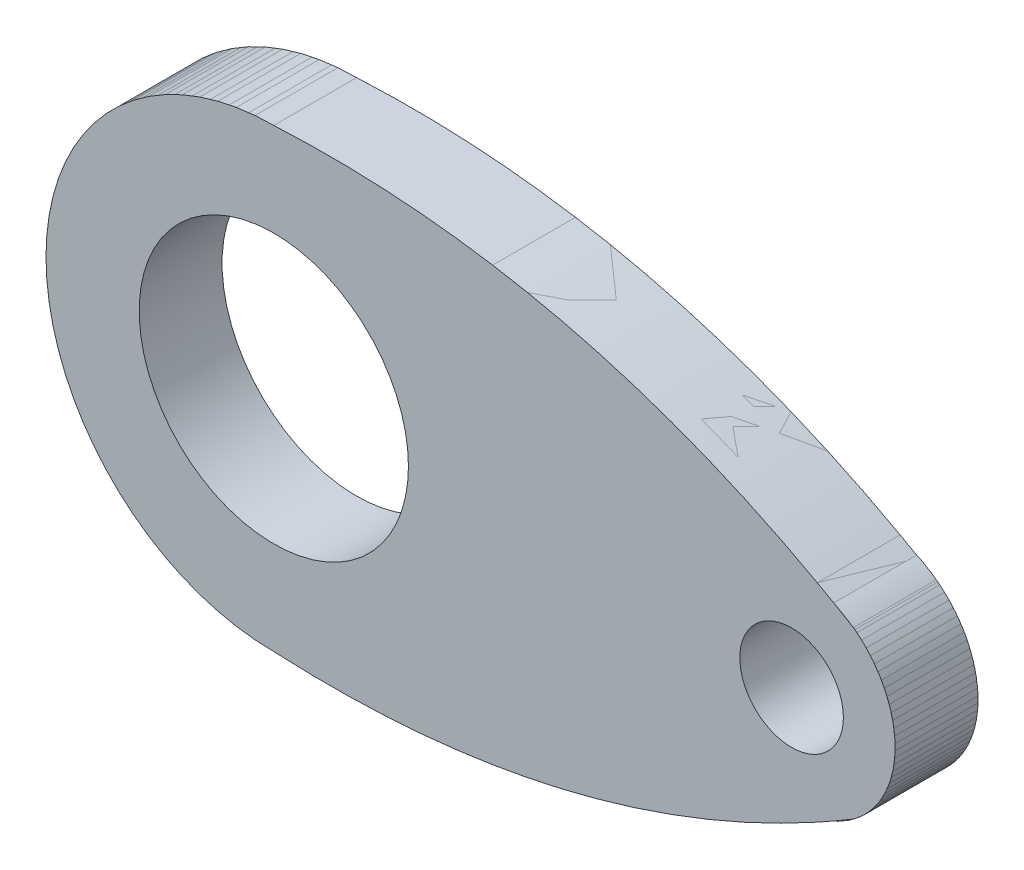
ISO-10303-21;
HEADER;
FILE_DESCRIPTION(('STEP AP214'),'2;1');
FILE_NAME('part.step','',(''),(''),'','','');
FILE_SCHEMA(('AUTOMOTIVE_DESIGN { 1 0 10303 214 1 1 1 1 }'));
ENDSEC;
DATA;
#1=APPLICATION_CONTEXT('core data for automotive mechanical design processes');
#2=APPLICATION_PROTOCOL_DEFINITION('international standard','automotive_design',2000,#1);
#3=PRODUCT_CONTEXT('',#1,'mechanical');
#4=PRODUCT('Part','Part','',(#3));
#5=PRODUCT_RELATED_PRODUCT_CATEGORY('part','',(#4));
#6=PRODUCT_DEFINITION_FORMATION('','',#4);
#7=PRODUCT_DEFINITION_CONTEXT('part definition',#1,'design');
#8=PRODUCT_DEFINITION('design','',#6,#7);
#9=PRODUCT_DEFINITION_SHAPE('','',#8);
#10=(LENGTH_UNIT() NAMED_UNIT(*) SI_UNIT(.MILLI.,.METRE.));
#11=(NAMED_UNIT(*) PLANE_ANGLE_UNIT() SI_UNIT($,.RADIAN.));
#12=(NAMED_UNIT(*) SI_UNIT($,.STERADIAN.) SOLID_ANGLE_UNIT());
#13=UNCERTAINTY_MEASURE_WITH_UNIT(LENGTH_MEASURE(1.E-05),#10,'distance_accuracy_value','');
#14=(GEOMETRIC_REPRESENTATION_CONTEXT(3) GLOBAL_UNCERTAINTY_ASSIGNED_CONTEXT((#13)) GLOBAL_UNIT_ASSIGNED_CONTEXT((#10,
#11,#12)) REPRESENTATION_CONTEXT('',''));
#15=CARTESIAN_POINT('',(0.,0.,0.));
#16=DIRECTION('',(0.,0.,1.));
#17=DIRECTION('',(1.,0.,0.));
#18=AXIS2_PLACEMENT_3D('',#15,#16,#17);
#19=CARTESIAN_POINT('',(-0.00634119172110252,-10.9999981600629,0.));
#20=CARTESIAN_POINT('',(15.1270318904217,-11.7684176821271,0.));
#21=CARTESIAN_POINT('',(28.0539293411729,-3.96618382733438,0.));
#22=B_SPLINE_CURVE_WITH_KNOTS('',2,(#19,#20,#21),.UNSPECIFIED.,.F.,.F.,(3,3),(0.,1.),.UNSPECIFIED.);
#23=DIRECTION('',(0.,0.,1.));
#24=VECTOR('',#23,1.);
#25=SURFACE_OF_LINEAR_EXTRUSION('',#22,#24);
#26=CARTESIAN_POINT('',(-0.00634119172110252,-10.9999981600629,4.));
#27=CARTESIAN_POINT('',(15.1270318904217,-11.7684176821271,4.));
#28=CARTESIAN_POINT('',(28.0539293411729,-3.96618382733438,4.));
#29=B_SPLINE_CURVE_WITH_KNOTS('',2,(#26,#27,#28),.UNSPECIFIED.,.F.,.F.,(3,3),(0.,1.),.UNSPECIFIED.);
#30=CARTESIAN_POINT('',(-0.00634119172110252,-10.9999981600629,4.));
#31=VERTEX_POINT('',#30);
#32=CARTESIAN_POINT('',(28.0539293411729,-3.96618382733438,4.));
#33=VERTEX_POINT('',#32);
#34=EDGE_CURVE('E74',#31,#33,#29,.T.);
#35=ORIENTED_EDGE('',*,*,#34,.F.);
#36=DIRECTION('',(0.,0.,1.));
#37=VECTOR('',#36,1.);
#38=CARTESIAN_POINT('',(-0.00634119172110252,-10.9999981600629,0.));
#39=LINE('',#38,#37);
#40=CARTESIAN_POINT('',(-0.00634119172110252,-10.9999981600629,0.));
#41=VERTEX_POINT('',#40);
#42=EDGE_CURVE('E56',#41,#31,#39,.T.);
#43=ORIENTED_EDGE('',*,*,#42,.F.);
#44=CARTESIAN_POINT('',(28.0539293411729,-3.96618382733438,0.));
#45=VERTEX_POINT('',#44);
#46=EDGE_CURVE('E62',#41,#45,#22,.T.);
#47=ORIENTED_EDGE('',*,*,#46,.T.);
#48=DIRECTION('',(0.,0.,1.));
#49=VECTOR('',#48,1.);
#50=CARTESIAN_POINT('',(28.0539293411729,-3.96618382733438,0.));
#51=LINE('',#50,#49);
#52=EDGE_CURVE('E12',#45,#33,#51,.T.);
#53=ORIENTED_EDGE('',*,*,#52,.T.);
#54=EDGE_LOOP('',(#35,#43,#47,#53));
#55=FACE_BOUND('',#54,.T.);
#56=ADVANCED_FACE('F54',(#55),#25,.T.);
#57=OPEN_SHELL('',(#56));
#58=SHELL_BASED_SURFACE_MODEL('B2',(#57));
#59=CARTESIAN_POINT('',(0.,11.,0.));
#60=CARTESIAN_POINT('',(15.1338132924348,11.7596957030618,0.));
#61=CARTESIAN_POINT('',(28.0562107953029,3.95001154992234,0.));
#62=B_SPLINE_CURVE_WITH_KNOTS('',2,(#59,#60,#61),.UNSPECIFIED.,.F.,.F.,(3,3),(0.,1.),.UNSPECIFIED.);
#63=DIRECTION('',(0.,0.,1.));
#64=VECTOR('',#63,1.);
#65=SURFACE_OF_LINEAR_EXTRUSION('',#62,#64);
#66=CARTESIAN_POINT('',(0.,11.,4.));
#67=CARTESIAN_POINT('',(15.1338132924348,11.7596957030618,4.));
#68=CARTESIAN_POINT('',(28.0562107953029,3.95001154992234,4.));
#69=B_SPLINE_CURVE_WITH_KNOTS('',2,(#66,#67,#68),.UNSPECIFIED.,.F.,.F.,(3,3),(0.,1.),.UNSPECIFIED.);
#70=CARTESIAN_POINT('',(0.,11.,4.));
#71=VERTEX_POINT('',#70);
#72=CARTESIAN_POINT('',(28.0562107953029,3.95001154992234,4.));
#73=VERTEX_POINT('',#72);
#74=EDGE_CURVE('E137',#71,#73,#69,.T.);
#75=ORIENTED_EDGE('',*,*,#74,.F.);
#76=DIRECTION('',(0.,0.,1.));
#77=VECTOR('',#76,1.);
#78=CARTESIAN_POINT('',(0.,11.,0.));
#79=LINE('',#78,#77);
#80=CARTESIAN_POINT('',(0.,11.,0.));
#81=VERTEX_POINT('',#80);
#82=EDGE_CURVE('E119',#81,#71,#79,.T.);
#83=ORIENTED_EDGE('',*,*,#82,.F.);
#84=CARTESIAN_POINT('',(28.0562107953029,3.95001154992234,0.));
#85=VERTEX_POINT('',#84);
#86=EDGE_CURVE('E125',#81,#85,#62,.T.);
#87=ORIENTED_EDGE('',*,*,#86,.T.);
#88=DIRECTION('',(0.,0.,1.));
#89=VECTOR('',#88,1.);
#90=CARTESIAN_POINT('',(28.0562107953029,3.95001154992234,0.));
#91=LINE('',#90,#89);
#92=EDGE_CURVE('E52',#85,#73,#91,.T.);
#93=ORIENTED_EDGE('',*,*,#92,.T.);
#94=EDGE_LOOP('',(#75,#83,#87,#93));
#95=FACE_BOUND('',#94,.T.);
#96=ADVANCED_FACE('F117',(#95),#65,.T.);
#97=OPEN_SHELL('',(#96));
#98=SHELL_BASED_SURFACE_MODEL('B6',(#97));
#99=CARTESIAN_POINT('',(24.9999989615263,-0.00720580916772559,0.));
#100=DIRECTION('',(0.,0.,1.));
#101=DIRECTION('',(1.,0.,0.));
#102=AXIS2_PLACEMENT_3D('',#99,#100,#101);
#103=CYLINDRICAL_SURFACE('',#102,5.);
#104=CARTESIAN_POINT('',(24.9999989615263,-0.00720580916772559,0.));
#105=DIRECTION('',(0.,0.,1.));
#106=DIRECTION('',(1.,0.,0.));
#107=AXIS2_PLACEMENT_3D('',#104,#105,#106);
#108=CIRCLE('',#107,5.);
#109=CARTESIAN_POINT('',(29.9999989615263,-0.00720580916772559,0.));
#110=VERTEX_POINT('',#109);
#111=EDGE_CURVE('E184',#110,#110,#108,.T.);
#112=ORIENTED_EDGE('',*,*,#111,.T.);
#113=EDGE_LOOP('',(#112));
#114=FACE_BOUND('',#113,.T.);
#115=CARTESIAN_POINT('',(24.9999989615263,-0.00720580916772559,4.));
#116=DIRECTION('',(0.,0.,1.));
#117=DIRECTION('',(1.,0.,0.));
#118=AXIS2_PLACEMENT_3D('',#115,#116,#117);
#119=CIRCLE('',#118,5.);
#120=CARTESIAN_POINT('',(29.9999989615263,-0.00720580916772559,4.));
#121=VERTEX_POINT('',#120);
#122=EDGE_CURVE('E116',#121,#121,#119,.T.);
#123=ORIENTED_EDGE('',*,*,#122,.F.);
#124=EDGE_LOOP('',(#123));
#125=FACE_BOUND('',#124,.T.);
#126=ADVANCED_FACE('F180',(#114,#125),#103,.T.);
#127=OPEN_SHELL('',(#126));
#128=SHELL_BASED_SURFACE_MODEL('B46',(#127));
#129=CARTESIAN_POINT('',(0.,0.,0.));
#130=DIRECTION('',(0.,0.,1.));
#131=DIRECTION('',(1.,0.,0.));
#132=AXIS2_PLACEMENT_3D('',#129,#130,#131);
#133=CYLINDRICAL_SURFACE('',#132,11.);
#134=CARTESIAN_POINT('',(0.,0.,0.));
#135=DIRECTION('',(0.,0.,1.));
#136=DIRECTION('',(1.,0.,0.));
#137=AXIS2_PLACEMENT_3D('',#134,#135,#136);
#138=CIRCLE('',#137,11.);
#139=CARTESIAN_POINT('',(11.,0.,0.));
#140=VERTEX_POINT('',#139);
#141=EDGE_CURVE('E218',#140,#140,#138,.T.);
#142=ORIENTED_EDGE('',*,*,#141,.T.);
#143=EDGE_LOOP('',(#142));
#144=FACE_BOUND('',#143,.T.);
#145=CARTESIAN_POINT('',(0.,0.,4.));
#146=DIRECTION('',(0.,0.,1.));
#147=DIRECTION('',(1.,0.,0.));
#148=AXIS2_PLACEMENT_3D('',#145,#146,#147);
#149=CIRCLE('',#148,11.);
#150=CARTESIAN_POINT('',(11.,0.,4.));
#151=VERTEX_POINT('',#150);
#152=EDGE_CURVE('E179',#151,#151,#149,.T.);
#153=ORIENTED_EDGE('',*,*,#152,.F.);
#154=EDGE_LOOP('',(#153));
#155=FACE_BOUND('',#154,.T.);
#156=ADVANCED_FACE('F214',(#144,#155),#133,.T.);
#157=OPEN_SHELL('',(#156));
#158=SHELL_BASED_SURFACE_MODEL('B111',(#157));
#159=CARTESIAN_POINT('',(0.,0.,4.));
#160=DIRECTION('',(0.,0.,-1.));
#161=DIRECTION('',(-1.,0.,0.));
#162=AXIS2_PLACEMENT_3D('',#159,#160,#161);
#163=CYLINDRICAL_SURFACE('',#162,11.);
#164=CARTESIAN_POINT('',(0.,0.,4.));
#165=DIRECTION('',(0.,0.,1.));
#166=DIRECTION('',(1.,0.,0.));
#167=AXIS2_PLACEMENT_3D('',#164,#165,#166);
#168=CIRCLE('',#167,11.);
#169=CARTESIAN_POINT('',(0.,11.,4.));
#170=VERTEX_POINT('',#169);
#171=CARTESIAN_POINT('',(-0.00634119172812238,-10.9999981722402,4.));
#172=VERTEX_POINT('',#171);
#173=EDGE_CURVE('E212',#170,#172,#168,.T.);
#174=ORIENTED_EDGE('',*,*,#173,.F.);
#175=DIRECTION('',(0.,0.,1.));
#176=VECTOR('',#175,1.);
#177=CARTESIAN_POINT('',(0.,11.,4.));
#178=LINE('',#177,#176);
#179=CARTESIAN_POINT('',(0.,11.,0.));
#180=VERTEX_POINT('',#179);
#181=EDGE_CURVE('E425',#180,#170,#178,.T.);
#182=ORIENTED_EDGE('',*,*,#181,.F.);
#183=CARTESIAN_POINT('',(0.,0.,0.));
#184=DIRECTION('',(0.,0.,1.));
#185=DIRECTION('',(1.,0.,0.));
#186=AXIS2_PLACEMENT_3D('',#183,#184,#185);
#187=CIRCLE('',#186,11.);
#188=CARTESIAN_POINT('',(-0.00634119172812238,-10.9999981722402,0.));
#189=VERTEX_POINT('',#188);
#190=EDGE_CURVE('E242',#180,#189,#187,.T.);
#191=ORIENTED_EDGE('',*,*,#190,.T.);
#192=DIRECTION('',(0.,0.,1.));
#193=VECTOR('',#192,1.);
#194=CARTESIAN_POINT('',(-0.00634119172110252,-10.9999981600629,4.));
#195=LINE('',#194,#193);
#196=EDGE_CURVE('E254',#189,#172,#195,.T.);
#197=ORIENTED_EDGE('',*,*,#196,.T.);
#198=EDGE_LOOP('',(#174,#182,#191,#197));
#199=FACE_BOUND('',#198,.T.);
#200=ADVANCED_FACE('F239',(#199),#163,.T.);
#201=CARTESIAN_POINT('',(0.,0.,4.));
#202=DIRECTION('',(0.,0.,1.));
#203=DIRECTION('',(1.,0.,0.));
#204=AXIS2_PLACEMENT_3D('',#201,#202,#203);
#205=PLANE('',#204);
#206=CARTESIAN_POINT('',(0.,0.,4.));
#207=DIRECTION('',(0.,0.,1.));
#208=DIRECTION('',(1.,0.,0.));
#209=AXIS2_PLACEMENT_3D('',#206,#207,#208);
#210=CIRCLE('',#209,6.5);
#211=CARTESIAN_POINT('',(6.5,0.,4.));
#212=VERTEX_POINT('',#211);
#213=EDGE_CURVE('E430',#212,#212,#210,.T.);
#214=ORIENTED_EDGE('',*,*,#213,.F.);
#215=EDGE_LOOP('',(#214));
#216=FACE_BOUND('',#215,.T.);
#217=ORIENTED_EDGE('',*,*,#173,.T.);
#218=CARTESIAN_POINT('',(-0.00634119172110252,-10.9999981600629,4.));
#219=CARTESIAN_POINT('',(15.1270318904217,-11.7684176821271,4.));
#220=CARTESIAN_POINT('',(28.0539293411729,-3.96618382733438,4.));
#221=B_SPLINE_CURVE_WITH_KNOTS('',2,(#218,#219,#220),.UNSPECIFIED.,.F.,.F.,(3,3),(0.,1.),.UNSPECIFIED.);
#222=CARTESIAN_POINT('',(28.0539294809174,-3.96618400849285,4.));
#223=VERTEX_POINT('',#222);
#224=EDGE_CURVE('E277',#172,#223,#221,.T.);
#225=ORIENTED_EDGE('',*,*,#224,.T.);
#226=CARTESIAN_POINT('',(24.9999989615263,-0.00720580916772559,4.));
#227=DIRECTION('',(0.,0.,1.));
#228=DIRECTION('',(1.,0.,0.));
#229=AXIS2_PLACEMENT_3D('',#226,#227,#228);
#230=CIRCLE('',#229,5.);
#231=CARTESIAN_POINT('',(28.0562107953029,3.95001154992233,4.));
#232=VERTEX_POINT('',#231);
#233=EDGE_CURVE('E283',#223,#232,#230,.T.);
#234=ORIENTED_EDGE('',*,*,#233,.T.);
#235=CARTESIAN_POINT('',(0.,11.,4.));
#236=CARTESIAN_POINT('',(15.1338132924348,11.7596957030618,4.));
#237=CARTESIAN_POINT('',(28.0562107953029,3.95001154992234,4.));
#238=B_SPLINE_CURVE_WITH_KNOTS('',2,(#235,#236,#237),.UNSPECIFIED.,.F.,.F.,(3,3),(0.,1.),.UNSPECIFIED.);
#239=EDGE_CURVE('E287',#170,#232,#238,.T.);
#240=ORIENTED_EDGE('',*,*,#239,.F.);
#241=EDGE_LOOP('',(#217,#225,#234,#240));
#242=FACE_BOUND('',#241,.T.);
#243=CARTESIAN_POINT('',(24.9999989615263,-0.00720580916772559,4.));
#244=DIRECTION('',(0.,0.,1.));
#245=DIRECTION('',(1.,0.,0.));
#246=AXIS2_PLACEMENT_3D('',#243,#244,#245);
#247=CIRCLE('',#246,2.5);
#248=CARTESIAN_POINT('',(27.4999989615263,-0.00720580916772559,4.));
#249=VERTEX_POINT('',#248);
#250=EDGE_CURVE('E312',#249,#249,#247,.T.);
#251=ORIENTED_EDGE('',*,*,#250,.F.);
#252=EDGE_LOOP('',(#251));
#253=FACE_BOUND('',#252,.T.);
#254=ADVANCED_FACE('F279',(#216,#242,#253),#205,.T.);
#255=CARTESIAN_POINT('',(0.,0.,0.));
#256=DIRECTION('',(0.,0.,1.));
#257=DIRECTION('',(1.,0.,0.));
#258=AXIS2_PLACEMENT_3D('',#255,#256,#257);
#259=PLANE('',#258);
#260=CARTESIAN_POINT('',(0.,0.,0.));
#261=DIRECTION('',(0.,0.,1.));
#262=DIRECTION('',(1.,0.,0.));
#263=AXIS2_PLACEMENT_3D('',#260,#261,#262);
#264=CIRCLE('',#263,6.5);
#265=CARTESIAN_POINT('',(6.5,0.,0.));
#266=VERTEX_POINT('',#265);
#267=EDGE_CURVE('E434',#266,#266,#264,.T.);
#268=ORIENTED_EDGE('',*,*,#267,.T.);
#269=EDGE_LOOP('',(#268));
#270=FACE_BOUND('',#269,.T.);
#271=ORIENTED_EDGE('',*,*,#190,.F.);
#272=CARTESIAN_POINT('',(0.,11.,0.));
#273=CARTESIAN_POINT('',(15.1338132924348,11.7596957030618,0.));
#274=CARTESIAN_POINT('',(28.0562107953029,3.95001154992234,0.));
#275=B_SPLINE_CURVE_WITH_KNOTS('',2,(#272,#273,#274),.UNSPECIFIED.,.F.,.F.,(3,3),(0.,1.),.UNSPECIFIED.);
#276=CARTESIAN_POINT('',(28.0562107953029,3.95001154992233,0.));
#277=VERTEX_POINT('',#276);
#278=EDGE_CURVE('E288',#180,#277,#275,.T.);
#279=ORIENTED_EDGE('',*,*,#278,.T.);
#280=CARTESIAN_POINT('',(24.9999989615263,-0.00720580916772559,0.));
#281=DIRECTION('',(0.,0.,1.));
#282=DIRECTION('',(1.,0.,0.));
#283=AXIS2_PLACEMENT_3D('',#280,#281,#282);
#284=CIRCLE('',#283,5.);
#285=CARTESIAN_POINT('',(28.0539294809174,-3.96618400849285,0.));
#286=VERTEX_POINT('',#285);
#287=EDGE_CURVE('E304',#286,#277,#284,.T.);
#288=ORIENTED_EDGE('',*,*,#287,.F.);
#289=CARTESIAN_POINT('',(-0.00634119172110252,-10.9999981600629,0.));
#290=CARTESIAN_POINT('',(15.1270318904217,-11.7684176821271,0.));
#291=CARTESIAN_POINT('',(28.0539293411729,-3.96618382733438,0.));
#292=B_SPLINE_CURVE_WITH_KNOTS('',2,(#289,#290,#291),.UNSPECIFIED.,.F.,.F.,(3,3),(0.,1.),.UNSPECIFIED.);
#293=EDGE_CURVE('E294',#189,#286,#292,.T.);
#294=ORIENTED_EDGE('',*,*,#293,.F.);
#295=EDGE_LOOP('',(#271,#279,#288,#294));
#296=FACE_BOUND('',#295,.T.);
#297=CARTESIAN_POINT('',(24.9999989615263,-0.00720580916772559,0.));
#298=DIRECTION('',(0.,0.,1.));
#299=DIRECTION('',(1.,0.,0.));
#300=AXIS2_PLACEMENT_3D('',#297,#298,#299);
#301=CIRCLE('',#300,2.5);
#302=CARTESIAN_POINT('',(27.4999989615263,-0.00720580916772559,0.));
#303=VERTEX_POINT('',#302);
#304=EDGE_CURVE('E309',#303,#303,#301,.T.);
#305=ORIENTED_EDGE('',*,*,#304,.T.);
#306=EDGE_LOOP('',(#305));
#307=FACE_BOUND('',#306,.T.);
#308=ADVANCED_FACE('F334',(#270,#296,#307),#259,.F.);
#309=CARTESIAN_POINT('',(0.,0.,0.));
#310=DIRECTION('',(0.,0.,1.));
#311=DIRECTION('',(1.,0.,0.));
#312=AXIS2_PLACEMENT_3D('',#309,#310,#311);
#313=CYLINDRICAL_SURFACE('',#312,6.5);
#314=ORIENTED_EDGE('',*,*,#267,.F.);
#315=EDGE_LOOP('',(#314));
#316=FACE_BOUND('',#315,.T.);
#317=ORIENTED_EDGE('',*,*,#213,.T.);
#318=EDGE_LOOP('',(#317));
#319=FACE_BOUND('',#318,.T.);
#320=ADVANCED_FACE('F331',(#316,#319),#313,.F.);
#321=DIRECTION('',(0.,0.,1.));
#322=VECTOR('',#321,1.);
#323=SURFACE_OF_LINEAR_EXTRUSION('',#238,#322);
#324=ORIENTED_EDGE('',*,*,#239,.T.);
#325=DIRECTION('',(0.,0.,-1.));
#326=VECTOR('',#325,1.);
#327=CARTESIAN_POINT('',(28.0562107953029,3.95001154992233,4.));
#328=LINE('',#327,#326);
#329=EDGE_CURVE('E299',#232,#277,#328,.T.);
#330=ORIENTED_EDGE('',*,*,#329,.T.);
#331=ORIENTED_EDGE('',*,*,#278,.F.);
#332=ORIENTED_EDGE('',*,*,#181,.T.);
#333=EDGE_LOOP('',(#324,#330,#331,#332));
#334=FACE_BOUND('',#333,.T.);
#335=ADVANCED_FACE('F329',(#334),#323,.F.);
#336=DIRECTION('',(0.,0.,1.));
#337=VECTOR('',#336,1.);
#338=SURFACE_OF_LINEAR_EXTRUSION('',#221,#337);
#339=ORIENTED_EDGE('',*,*,#293,.T.);
#340=DIRECTION('',(0.,0.,-1.));
#341=VECTOR('',#340,1.);
#342=CARTESIAN_POINT('',(28.0539294809174,-3.96618400849285,4.));
#343=LINE('',#342,#341);
#344=EDGE_CURVE('E291',#223,#286,#343,.T.);
#345=ORIENTED_EDGE('',*,*,#344,.F.);
#346=ORIENTED_EDGE('',*,*,#224,.F.);
#347=ORIENTED_EDGE('',*,*,#196,.F.);
#348=EDGE_LOOP('',(#339,#345,#346,#347));
#349=FACE_BOUND('',#348,.T.);
#350=ADVANCED_FACE('F292',(#349),#338,.T.);
#351=CARTESIAN_POINT('',(24.9999989615263,-0.00720580916772559,4.));
#352=DIRECTION('',(0.,0.,-1.));
#353=DIRECTION('',(-1.,0.,0.));
#354=AXIS2_PLACEMENT_3D('',#351,#352,#353);
#355=CYLINDRICAL_SURFACE('',#354,5.);
#356=ORIENTED_EDGE('',*,*,#287,.T.);
#357=ORIENTED_EDGE('',*,*,#329,.F.);
#358=ORIENTED_EDGE('',*,*,#233,.F.);
#359=ORIENTED_EDGE('',*,*,#344,.T.);
#360=EDGE_LOOP('',(#356,#357,#358,#359));
#361=FACE_BOUND('',#360,.T.);
#362=ADVANCED_FACE('F301',(#361),#355,.T.);
#363=CARTESIAN_POINT('',(24.9999989615263,-0.00720580916772559,0.));
#364=DIRECTION('',(0.,0.,1.));
#365=DIRECTION('',(1.,0.,0.));
#366=AXIS2_PLACEMENT_3D('',#363,#364,#365);
#367=CYLINDRICAL_SURFACE('',#366,2.5);
#368=ORIENTED_EDGE('',*,*,#304,.F.);
#369=EDGE_LOOP('',(#368));
#370=FACE_BOUND('',#369,.T.);
#371=ORIENTED_EDGE('',*,*,#250,.T.);
#372=EDGE_LOOP('',(#371));
#373=FACE_BOUND('',#372,.T.);
#374=ADVANCED_FACE('F383',(#370,#373),#367,.F.);
#375=CLOSED_SHELL('',(#200,#254,#308,#320,#335,#350,#362,#374));
#376=MANIFOLD_SOLID_BREP('B174',#375);
#377=ADVANCED_BREP_SHAPE_REPRESENTATION('',(#18,#376),#14);
#378=MANIFOLD_SURFACE_SHAPE_REPRESENTATION('',(#18,#58,#98,#128,#158),#14);
#379=SHAPE_REPRESENTATION('',(#18),#14);
#380=SHAPE_DEFINITION_REPRESENTATION(#9,#379);
#381=SHAPE_REPRESENTATION_RELATIONSHIP('','',#379,#377);
#382=SHAPE_REPRESENTATION_RELATIONSHIP('','',#379,#378);
ENDSEC;
END-ISO-10303-21;
